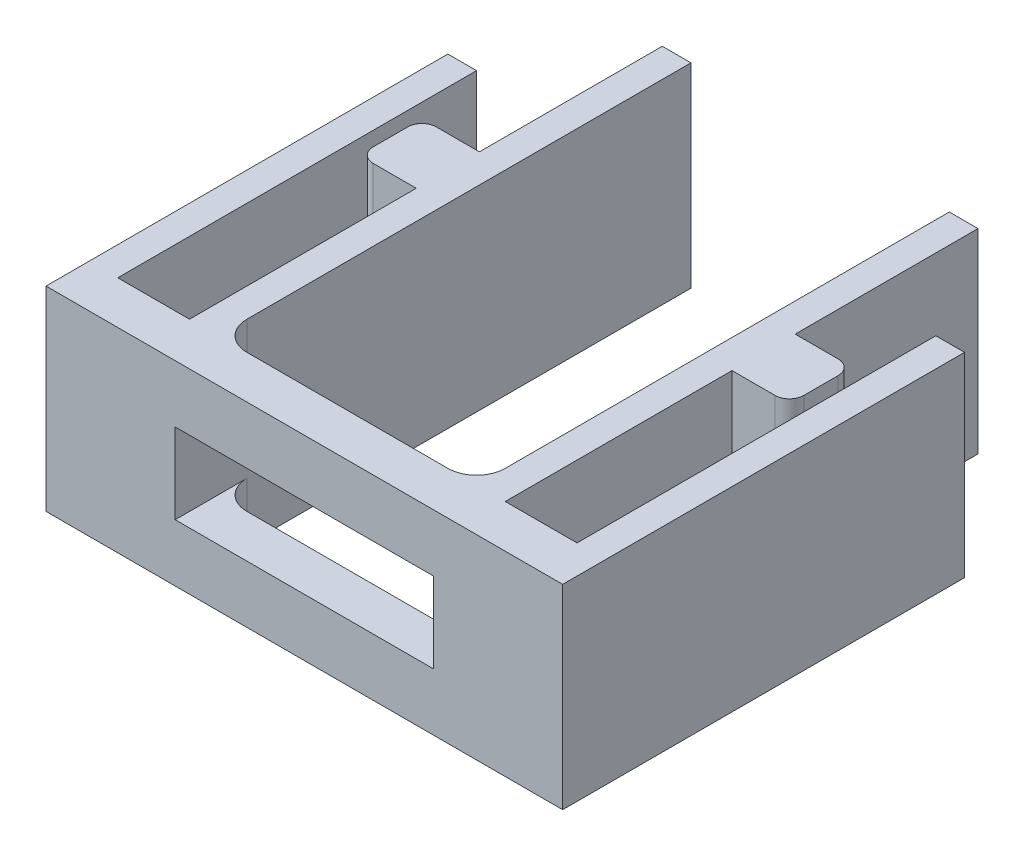
ISO-10303-21;
HEADER;
FILE_DESCRIPTION(('STEP AP214'),'2;1');
FILE_NAME('part.step','',(''),(''),'','','');
FILE_SCHEMA(('AUTOMOTIVE_DESIGN { 1 0 10303 214 1 1 1 1 }'));
ENDSEC;
DATA;
#1=APPLICATION_CONTEXT('core data for automotive mechanical design processes');
#2=APPLICATION_PROTOCOL_DEFINITION('international standard','automotive_design',2000,#1);
#3=PRODUCT_CONTEXT('',#1,'mechanical');
#4=PRODUCT('Part','Part','',(#3));
#5=PRODUCT_RELATED_PRODUCT_CATEGORY('part','',(#4));
#6=PRODUCT_DEFINITION_FORMATION('','',#4);
#7=PRODUCT_DEFINITION_CONTEXT('part definition',#1,'design');
#8=PRODUCT_DEFINITION('design','',#6,#7);
#9=PRODUCT_DEFINITION_SHAPE('','',#8);
#10=(LENGTH_UNIT() NAMED_UNIT(*) SI_UNIT(.MILLI.,.METRE.));
#11=(NAMED_UNIT(*) PLANE_ANGLE_UNIT() SI_UNIT($,.RADIAN.));
#12=(NAMED_UNIT(*) SI_UNIT($,.STERADIAN.) SOLID_ANGLE_UNIT());
#13=UNCERTAINTY_MEASURE_WITH_UNIT(LENGTH_MEASURE(1.E-05),#10,'distance_accuracy_value','');
#14=(GEOMETRIC_REPRESENTATION_CONTEXT(3) GLOBAL_UNCERTAINTY_ASSIGNED_CONTEXT((#13)) GLOBAL_UNIT_ASSIGNED_CONTEXT((#10,
#11,#12)) REPRESENTATION_CONTEXT('',''));
#15=CARTESIAN_POINT('',(0.,0.,0.));
#16=DIRECTION('',(0.,0.,1.));
#17=DIRECTION('',(1.,0.,0.));
#18=AXIS2_PLACEMENT_3D('',#15,#16,#17);
#19=CARTESIAN_POINT('',(12.5,6.8,-2.5));
#20=DIRECTION('',(0.,-1.,0.));
#21=DIRECTION('',(0.,0.,-1.));
#22=AXIS2_PLACEMENT_3D('',#19,#20,#21);
#23=CYLINDRICAL_SURFACE('',#22,1.);
#24=DIRECTION('',(0.,-1.,0.));
#25=VECTOR('',#24,1.);
#26=CARTESIAN_POINT('',(13.5,6.8,-2.5));
#27=LINE('',#26,#25);
#28=CARTESIAN_POINT('',(13.5,6.8,-2.5));
#29=VERTEX_POINT('',#28);
#30=CARTESIAN_POINT('',(13.5,4.8,-2.5));
#31=VERTEX_POINT('',#30);
#32=EDGE_CURVE('E469',#29,#31,#27,.T.);
#33=ORIENTED_EDGE('',*,*,#32,.T.);
#34=CARTESIAN_POINT('',(12.5,4.8,-2.5));
#35=DIRECTION('',(0.,1.,0.));
#36=DIRECTION('',(-1.,0.,0.));
#37=AXIS2_PLACEMENT_3D('',#34,#35,#36);
#38=CIRCLE('',#37,1.);
#39=CARTESIAN_POINT('',(12.5,4.8,-1.5));
#40=VERTEX_POINT('',#39);
#41=EDGE_CURVE('E315',#31,#40,#38,.F.);
#42=ORIENTED_EDGE('',*,*,#41,.T.);
#43=DIRECTION('',(0.,-1.,0.));
#44=VECTOR('',#43,1.);
#45=CARTESIAN_POINT('',(12.5,6.8,-1.5));
#46=LINE('',#45,#44);
#47=CARTESIAN_POINT('',(12.5,6.8,-1.5));
#48=VERTEX_POINT('',#47);
#49=EDGE_CURVE('E466',#48,#40,#46,.T.);
#50=ORIENTED_EDGE('',*,*,#49,.F.);
#51=CARTESIAN_POINT('',(12.5,6.8,-2.5));
#52=DIRECTION('',(0.,-1.,0.));
#53=DIRECTION('',(0.,0.,1.));
#54=AXIS2_PLACEMENT_3D('',#51,#52,#53);
#55=CIRCLE('',#54,1.);
#56=EDGE_CURVE('E346',#29,#48,#55,.T.);
#57=ORIENTED_EDGE('',*,*,#56,.F.);
#58=EDGE_LOOP('',(#33,#42,#50,#57));
#59=FACE_BOUND('',#58,.T.);
#60=ADVANCED_FACE('F33',(#59),#23,.F.);
#61=CARTESIAN_POINT('',(5.5,6.8,-1.5));
#62=DIRECTION('',(0.,0.,1.));
#63=DIRECTION('',(1.,0.,0.));
#64=AXIS2_PLACEMENT_3D('',#61,#62,#63);
#65=PLANE('',#64);
#66=ORIENTED_EDGE('',*,*,#49,.T.);
#67=DIRECTION('',(-1.,0.,0.));
#68=VECTOR('',#67,1.);
#69=CARTESIAN_POINT('',(5.5,4.8,-1.5));
#70=LINE('',#69,#68);
#71=CARTESIAN_POINT('',(5.5,4.8,-1.5));
#72=VERTEX_POINT('',#71);
#73=EDGE_CURVE('E312',#40,#72,#70,.T.);
#74=ORIENTED_EDGE('',*,*,#73,.T.);
#75=DIRECTION('',(0.,-1.,0.));
#76=VECTOR('',#75,1.);
#77=CARTESIAN_POINT('',(5.5,6.8,-1.5));
#78=LINE('',#77,#76);
#79=CARTESIAN_POINT('',(5.5,6.8,-1.5));
#80=VERTEX_POINT('',#79);
#81=EDGE_CURVE('E462',#80,#72,#78,.T.);
#82=ORIENTED_EDGE('',*,*,#81,.F.);
#83=DIRECTION('',(-1.,0.,0.));
#84=VECTOR('',#83,1.);
#85=CARTESIAN_POINT('',(5.5,6.8,-1.5));
#86=LINE('',#85,#84);
#87=EDGE_CURVE('E348',#48,#80,#86,.T.);
#88=ORIENTED_EDGE('',*,*,#87,.F.);
#89=EDGE_LOOP('',(#66,#74,#82,#88));
#90=FACE_BOUND('',#89,.T.);
#91=ADVANCED_FACE('F646',(#90),#65,.F.);
#92=CARTESIAN_POINT('',(5.5,6.8,-2.5));
#93=DIRECTION('',(0.,-1.,0.));
#94=DIRECTION('',(0.,0.,-1.));
#95=AXIS2_PLACEMENT_3D('',#92,#93,#94);
#96=CYLINDRICAL_SURFACE('',#95,1.);
#97=ORIENTED_EDGE('',*,*,#81,.T.);
#98=CARTESIAN_POINT('',(5.5,4.8,-2.5));
#99=DIRECTION('',(0.,1.,0.));
#100=DIRECTION('',(-1.,0.,0.));
#101=AXIS2_PLACEMENT_3D('',#98,#99,#100);
#102=CIRCLE('',#101,1.);
#103=CARTESIAN_POINT('',(4.5,4.8,-2.5));
#104=VERTEX_POINT('',#103);
#105=EDGE_CURVE('E309',#72,#104,#102,.F.);
#106=ORIENTED_EDGE('',*,*,#105,.T.);
#107=DIRECTION('',(0.,-1.,0.));
#108=VECTOR('',#107,1.);
#109=CARTESIAN_POINT('',(4.5,6.8,-2.5));
#110=LINE('',#109,#108);
#111=CARTESIAN_POINT('',(4.5,6.8,-2.5));
#112=VERTEX_POINT('',#111);
#113=EDGE_CURVE('E458',#112,#104,#110,.T.);
#114=ORIENTED_EDGE('',*,*,#113,.F.);
#115=CARTESIAN_POINT('',(5.5,6.8,-2.5));
#116=DIRECTION('',(0.,-1.,0.));
#117=DIRECTION('',(0.,0.,-1.));
#118=AXIS2_PLACEMENT_3D('',#115,#116,#117);
#119=CIRCLE('',#118,1.);
#120=EDGE_CURVE('E350',#80,#112,#119,.T.);
#121=ORIENTED_EDGE('',*,*,#120,.F.);
#122=EDGE_LOOP('',(#97,#106,#114,#121));
#123=FACE_BOUND('',#122,.T.);
#124=ADVANCED_FACE('F648',(#123),#96,.F.);
#125=CARTESIAN_POINT('',(18.,6.8,0.));
#126=DIRECTION('',(0.,0.,-1.));
#127=DIRECTION('',(-1.,0.,0.));
#128=AXIS2_PLACEMENT_3D('',#125,#126,#127);
#129=PLANE('',#128);
#130=DIRECTION('',(1.,0.,0.));
#131=VECTOR('',#130,1.);
#132=CARTESIAN_POINT('',(13.5,2.,0.));
#133=LINE('',#132,#131);
#134=CARTESIAN_POINT('',(4.5,2.,0.));
#135=VERTEX_POINT('',#134);
#136=CARTESIAN_POINT('',(13.5,2.,0.));
#137=VERTEX_POINT('',#136);
#138=EDGE_CURVE('E282',#135,#137,#133,.T.);
#139=ORIENTED_EDGE('',*,*,#138,.F.);
#140=DIRECTION('',(0.,-1.,0.));
#141=VECTOR('',#140,1.);
#142=CARTESIAN_POINT('',(4.5,2.,0.));
#143=LINE('',#142,#141);
#144=CARTESIAN_POINT('',(4.5,4.8,0.));
#145=VERTEX_POINT('',#144);
#146=EDGE_CURVE('E287',#145,#135,#143,.T.);
#147=ORIENTED_EDGE('',*,*,#146,.F.);
#148=DIRECTION('',(-1.,0.,0.));
#149=VECTOR('',#148,1.);
#150=CARTESIAN_POINT('',(13.5,4.8,0.));
#151=LINE('',#150,#149);
#152=CARTESIAN_POINT('',(13.5,4.8,0.));
#153=VERTEX_POINT('',#152);
#154=EDGE_CURVE('E292',#153,#145,#151,.T.);
#155=ORIENTED_EDGE('',*,*,#154,.F.);
#156=DIRECTION('',(0.,1.,0.));
#157=VECTOR('',#156,1.);
#158=CARTESIAN_POINT('',(13.5,2.,0.));
#159=LINE('',#158,#157);
#160=EDGE_CURVE('E271',#137,#153,#159,.T.);
#161=ORIENTED_EDGE('',*,*,#160,.F.);
#162=EDGE_LOOP('',(#139,#147,#155,#161));
#163=FACE_BOUND('',#162,.T.);
#164=DIRECTION('',(1.,0.,0.));
#165=VECTOR('',#164,1.);
#166=CARTESIAN_POINT('',(18.,0.,0.));
#167=LINE('',#166,#165);
#168=CARTESIAN_POINT('',(0.,0.,0.));
#169=VERTEX_POINT('',#168);
#170=CARTESIAN_POINT('',(18.,0.,0.));
#171=VERTEX_POINT('',#170);
#172=EDGE_CURVE('E318',#169,#171,#167,.T.);
#173=ORIENTED_EDGE('',*,*,#172,.T.);
#174=DIRECTION('',(0.,-1.,0.));
#175=VECTOR('',#174,1.);
#176=CARTESIAN_POINT('',(18.,6.8,0.));
#177=LINE('',#176,#175);
#178=CARTESIAN_POINT('',(18.,6.8,0.));
#179=VERTEX_POINT('',#178);
#180=EDGE_CURVE('E495',#179,#171,#177,.T.);
#181=ORIENTED_EDGE('',*,*,#180,.F.);
#182=DIRECTION('',(1.,0.,0.));
#183=VECTOR('',#182,1.);
#184=CARTESIAN_POINT('',(18.,6.8,0.));
#185=LINE('',#184,#183);
#186=CARTESIAN_POINT('',(0.,6.8,0.));
#187=VERTEX_POINT('',#186);
#188=EDGE_CURVE('E319',#187,#179,#185,.T.);
#189=ORIENTED_EDGE('',*,*,#188,.F.);
#190=DIRECTION('',(0.,-1.,0.));
#191=VECTOR('',#190,1.);
#192=CARTESIAN_POINT('',(0.,6.8,0.));
#193=LINE('',#192,#191);
#194=EDGE_CURVE('E374',#187,#169,#193,.T.);
#195=ORIENTED_EDGE('',*,*,#194,.T.);
#196=EDGE_LOOP('',(#173,#181,#189,#195));
#197=FACE_BOUND('',#196,.T.);
#198=ADVANCED_FACE('F289',(#163,#197),#129,.F.);
#199=CARTESIAN_POINT('',(18.,6.8,-14.));
#200=DIRECTION('',(-1.,0.,0.));
#201=DIRECTION('',(0.,0.,1.));
#202=AXIS2_PLACEMENT_3D('',#199,#200,#201);
#203=PLANE('',#202);
#204=DIRECTION('',(0.,0.,-1.));
#205=VECTOR('',#204,1.);
#206=CARTESIAN_POINT('',(18.,0.,-14.));
#207=LINE('',#206,#205);
#208=CARTESIAN_POINT('',(18.,0.,-14.));
#209=VERTEX_POINT('',#208);
#210=EDGE_CURVE('E377',#171,#209,#207,.T.);
#211=ORIENTED_EDGE('',*,*,#210,.T.);
#212=DIRECTION('',(0.,-1.,0.));
#213=VECTOR('',#212,1.);
#214=CARTESIAN_POINT('',(18.,6.8,-14.));
#215=LINE('',#214,#213);
#216=CARTESIAN_POINT('',(18.,6.8,-14.));
#217=VERTEX_POINT('',#216);
#218=EDGE_CURVE('E492',#217,#209,#215,.T.);
#219=ORIENTED_EDGE('',*,*,#218,.F.);
#220=DIRECTION('',(0.,0.,-1.));
#221=VECTOR('',#220,1.);
#222=CARTESIAN_POINT('',(18.,6.8,-14.));
#223=LINE('',#222,#221);
#224=EDGE_CURVE('E322',#179,#217,#223,.T.);
#225=ORIENTED_EDGE('',*,*,#224,.F.);
#226=ORIENTED_EDGE('',*,*,#180,.T.);
#227=EDGE_LOOP('',(#211,#219,#225,#226));
#228=FACE_BOUND('',#227,.T.);
#229=ADVANCED_FACE('F580',(#228),#203,.F.);
#230=CARTESIAN_POINT('',(17.,6.8,-14.));
#231=DIRECTION('',(0.,0.,1.));
#232=DIRECTION('',(1.,0.,0.));
#233=AXIS2_PLACEMENT_3D('',#230,#231,#232);
#234=PLANE('',#233);
#235=DIRECTION('',(-1.,0.,0.));
#236=VECTOR('',#235,1.);
#237=CARTESIAN_POINT('',(17.,0.,-14.));
#238=LINE('',#237,#236);
#239=CARTESIAN_POINT('',(17.,0.,-14.));
#240=VERTEX_POINT('',#239);
#241=EDGE_CURVE('E379',#209,#240,#238,.T.);
#242=ORIENTED_EDGE('',*,*,#241,.T.);
#243=DIRECTION('',(0.,-1.,0.));
#244=VECTOR('',#243,1.);
#245=CARTESIAN_POINT('',(17.,6.8,-14.));
#246=LINE('',#245,#244);
#247=CARTESIAN_POINT('',(17.,6.8,-14.));
#248=VERTEX_POINT('',#247);
#249=EDGE_CURVE('E489',#248,#240,#246,.T.);
#250=ORIENTED_EDGE('',*,*,#249,.F.);
#251=DIRECTION('',(-1.,0.,0.));
#252=VECTOR('',#251,1.);
#253=CARTESIAN_POINT('',(17.,6.8,-14.));
#254=LINE('',#253,#252);
#255=EDGE_CURVE('E325',#217,#248,#254,.T.);
#256=ORIENTED_EDGE('',*,*,#255,.F.);
#257=ORIENTED_EDGE('',*,*,#218,.T.);
#258=EDGE_LOOP('',(#242,#250,#256,#257));
#259=FACE_BOUND('',#258,.T.);
#260=ADVANCED_FACE('F587',(#259),#234,.F.);
#261=CARTESIAN_POINT('',(17.,6.8,-1.5));
#262=DIRECTION('',(1.,0.,0.));
#263=DIRECTION('',(0.,0.,-1.));
#264=AXIS2_PLACEMENT_3D('',#261,#262,#263);
#265=PLANE('',#264);
#266=DIRECTION('',(0.,0.,1.));
#267=VECTOR('',#266,1.);
#268=CARTESIAN_POINT('',(17.,0.,-1.5));
#269=LINE('',#268,#267);
#270=CARTESIAN_POINT('',(17.,0.,-1.5));
#271=VERTEX_POINT('',#270);
#272=EDGE_CURVE('E381',#240,#271,#269,.T.);
#273=ORIENTED_EDGE('',*,*,#272,.T.);
#274=DIRECTION('',(0.,-1.,0.));
#275=VECTOR('',#274,1.);
#276=CARTESIAN_POINT('',(17.,6.8,-1.5));
#277=LINE('',#276,#275);
#278=CARTESIAN_POINT('',(17.,6.8,-1.5));
#279=VERTEX_POINT('',#278);
#280=EDGE_CURVE('E486',#279,#271,#277,.T.);
#281=ORIENTED_EDGE('',*,*,#280,.F.);
#282=DIRECTION('',(0.,0.,1.));
#283=VECTOR('',#282,1.);
#284=CARTESIAN_POINT('',(17.,6.8,-1.5));
#285=LINE('',#284,#283);
#286=EDGE_CURVE('E327',#248,#279,#285,.T.);
#287=ORIENTED_EDGE('',*,*,#286,.F.);
#288=ORIENTED_EDGE('',*,*,#249,.T.);
#289=EDGE_LOOP('',(#273,#281,#287,#288));
#290=FACE_BOUND('',#289,.T.);
#291=ADVANCED_FACE('F591',(#290),#265,.F.);
#292=CARTESIAN_POINT('',(14.5,6.8,-1.5));
#293=DIRECTION('',(0.,0.,1.));
#294=DIRECTION('',(1.,0.,0.));
#295=AXIS2_PLACEMENT_3D('',#292,#293,#294);
#296=PLANE('',#295);
#297=DIRECTION('',(-1.,0.,0.));
#298=VECTOR('',#297,1.);
#299=CARTESIAN_POINT('',(14.5,0.,-1.5));
#300=LINE('',#299,#298);
#301=CARTESIAN_POINT('',(14.5,0.,-1.5));
#302=VERTEX_POINT('',#301);
#303=EDGE_CURVE('E383',#271,#302,#300,.T.);
#304=ORIENTED_EDGE('',*,*,#303,.T.);
#305=DIRECTION('',(0.,-1.,0.));
#306=VECTOR('',#305,1.);
#307=CARTESIAN_POINT('',(14.5,6.8,-1.5));
#308=LINE('',#307,#306);
#309=CARTESIAN_POINT('',(14.5,6.8,-1.5));
#310=VERTEX_POINT('',#309);
#311=EDGE_CURVE('E483',#310,#302,#308,.T.);
#312=ORIENTED_EDGE('',*,*,#311,.F.);
#313=DIRECTION('',(-1.,0.,0.));
#314=VECTOR('',#313,1.);
#315=CARTESIAN_POINT('',(14.5,6.8,-1.5));
#316=LINE('',#315,#314);
#317=EDGE_CURVE('E329',#279,#310,#316,.T.);
#318=ORIENTED_EDGE('',*,*,#317,.F.);
#319=ORIENTED_EDGE('',*,*,#280,.T.);
#320=EDGE_LOOP('',(#304,#312,#318,#319));
#321=FACE_BOUND('',#320,.T.);
#322=ADVANCED_FACE('F596',(#321),#296,.F.);
#323=CARTESIAN_POINT('',(14.5,6.8,-9.39999999999998));
#324=DIRECTION('',(-1.,0.,0.));
#325=DIRECTION('',(0.,0.,1.));
#326=AXIS2_PLACEMENT_3D('',#323,#324,#325);
#327=PLANE('',#326);
#328=DIRECTION('',(0.,0.,-1.));
#329=VECTOR('',#328,1.);
#330=CARTESIAN_POINT('',(14.5,0.,-9.39999999999998));
#331=LINE('',#330,#329);
#332=CARTESIAN_POINT('',(14.5,0.,-9.39999999999998));
#333=VERTEX_POINT('',#332);
#334=EDGE_CURVE('E385',#302,#333,#331,.T.);
#335=ORIENTED_EDGE('',*,*,#334,.T.);
#336=DIRECTION('',(0.,-1.,0.));
#337=VECTOR('',#336,1.);
#338=CARTESIAN_POINT('',(14.5,6.8,-9.39999999999998));
#339=LINE('',#338,#337);
#340=CARTESIAN_POINT('',(14.5,6.8,-9.39999999999998));
#341=VERTEX_POINT('',#340);
#342=EDGE_CURVE('E480',#341,#333,#339,.T.);
#343=ORIENTED_EDGE('',*,*,#342,.F.);
#344=DIRECTION('',(0.,0.,-1.));
#345=VECTOR('',#344,1.);
#346=CARTESIAN_POINT('',(14.5,6.8,-9.39999999999998));
#347=LINE('',#346,#345);
#348=EDGE_CURVE('E331',#310,#341,#347,.T.);
#349=ORIENTED_EDGE('',*,*,#348,.F.);
#350=ORIENTED_EDGE('',*,*,#311,.T.);
#351=EDGE_LOOP('',(#335,#343,#349,#350));
#352=FACE_BOUND('',#351,.T.);
#353=ADVANCED_FACE('F602',(#352),#327,.F.);
#354=CARTESIAN_POINT('',(16.5,6.8,-9.39999999999999));
#355=DIRECTION('',(0.,0.,-1.));
#356=DIRECTION('',(-1.,0.,0.));
#357=AXIS2_PLACEMENT_3D('',#354,#355,#356);
#358=PLANE('',#357);
#359=DIRECTION('',(1.,0.,0.));
#360=VECTOR('',#359,1.);
#361=CARTESIAN_POINT('',(16.5,0.,-9.39999999999999));
#362=LINE('',#361,#360);
#363=CARTESIAN_POINT('',(16.,0.,-9.39999999999999));
#364=VERTEX_POINT('',#363);
#365=EDGE_CURVE('E387',#333,#364,#362,.T.);
#366=ORIENTED_EDGE('',*,*,#365,.T.);
#367=DIRECTION('',(0.,-1.,0.));
#368=VECTOR('',#367,1.);
#369=CARTESIAN_POINT('',(16.,6.8,-9.39999999999999));
#370=LINE('',#369,#368);
#371=CARTESIAN_POINT('',(16.,6.8,-9.39999999999999));
#372=VERTEX_POINT('',#371);
#373=EDGE_CURVE('E514',#364,#372,#370,.F.);
#374=ORIENTED_EDGE('',*,*,#373,.T.);
#375=DIRECTION('',(1.,0.,0.));
#376=VECTOR('',#375,1.);
#377=CARTESIAN_POINT('',(16.5,6.8,-9.39999999999999));
#378=LINE('',#377,#376);
#379=EDGE_CURVE('E333',#341,#372,#378,.T.);
#380=ORIENTED_EDGE('',*,*,#379,.F.);
#381=ORIENTED_EDGE('',*,*,#342,.T.);
#382=EDGE_LOOP('',(#366,#374,#380,#381));
#383=FACE_BOUND('',#382,.T.);
#384=ADVANCED_FACE('F606',(#383),#358,.F.);
#385=CARTESIAN_POINT('',(16.5,6.8,-11.6));
#386=DIRECTION('',(-1.,0.,0.));
#387=DIRECTION('',(0.,0.,1.));
#388=AXIS2_PLACEMENT_3D('',#385,#386,#387);
#389=PLANE('',#388);
#390=DIRECTION('',(0.,0.,-1.));
#391=VECTOR('',#390,1.);
#392=CARTESIAN_POINT('',(16.5,6.8,-11.6));
#393=LINE('',#392,#391);
#394=CARTESIAN_POINT('',(16.5,6.8,-9.89999999999999));
#395=VERTEX_POINT('',#394);
#396=CARTESIAN_POINT('',(16.5,6.8,-11.1));
#397=VERTEX_POINT('',#396);
#398=EDGE_CURVE('E336',#395,#397,#393,.T.);
#399=ORIENTED_EDGE('',*,*,#398,.F.);
#400=DIRECTION('',(0.,-1.,0.));
#401=VECTOR('',#400,1.);
#402=CARTESIAN_POINT('',(16.5,6.8,-9.89999999999999));
#403=LINE('',#402,#401);
#404=CARTESIAN_POINT('',(16.5,0.,-9.89999999999999));
#405=VERTEX_POINT('',#404);
#406=EDGE_CURVE('E509',#395,#405,#403,.T.);
#407=ORIENTED_EDGE('',*,*,#406,.T.);
#408=DIRECTION('',(0.,0.,-1.));
#409=VECTOR('',#408,1.);
#410=CARTESIAN_POINT('',(16.5,0.,-11.6));
#411=LINE('',#410,#409);
#412=CARTESIAN_POINT('',(16.5,0.,-11.1));
#413=VERTEX_POINT('',#412);
#414=EDGE_CURVE('E390',#405,#413,#411,.T.);
#415=ORIENTED_EDGE('',*,*,#414,.T.);
#416=DIRECTION('',(0.,-1.,0.));
#417=VECTOR('',#416,1.);
#418=CARTESIAN_POINT('',(16.5,6.8,-11.1));
#419=LINE('',#418,#417);
#420=EDGE_CURVE('E504',#413,#397,#419,.F.);
#421=ORIENTED_EDGE('',*,*,#420,.T.);
#422=EDGE_LOOP('',(#399,#407,#415,#421));
#423=FACE_BOUND('',#422,.T.);
#424=ADVANCED_FACE('F613',(#423),#389,.F.);
#425=CARTESIAN_POINT('',(14.5,6.8,-11.6));
#426=DIRECTION('',(0.,0.,1.));
#427=DIRECTION('',(1.,0.,0.));
#428=AXIS2_PLACEMENT_3D('',#425,#426,#427);
#429=PLANE('',#428);
#430=DIRECTION('',(-1.,0.,0.));
#431=VECTOR('',#430,1.);
#432=CARTESIAN_POINT('',(14.5,6.8,-11.6));
#433=LINE('',#432,#431);
#434=CARTESIAN_POINT('',(16.,6.8,-11.6));
#435=VERTEX_POINT('',#434);
#436=CARTESIAN_POINT('',(14.5,6.8,-11.6));
#437=VERTEX_POINT('',#436);
#438=EDGE_CURVE('E338',#435,#437,#433,.T.);
#439=ORIENTED_EDGE('',*,*,#438,.F.);
#440=DIRECTION('',(0.,-1.,0.));
#441=VECTOR('',#440,1.);
#442=CARTESIAN_POINT('',(16.,6.8,-11.6));
#443=LINE('',#442,#441);
#444=CARTESIAN_POINT('',(16.,0.,-11.6));
#445=VERTEX_POINT('',#444);
#446=EDGE_CURVE('E498',#435,#445,#443,.T.);
#447=ORIENTED_EDGE('',*,*,#446,.T.);
#448=DIRECTION('',(-1.,0.,0.));
#449=VECTOR('',#448,1.);
#450=CARTESIAN_POINT('',(14.5,0.,-11.6));
#451=LINE('',#450,#449);
#452=CARTESIAN_POINT('',(14.5,0.,-11.6));
#453=VERTEX_POINT('',#452);
#454=EDGE_CURVE('E392',#445,#453,#451,.T.);
#455=ORIENTED_EDGE('',*,*,#454,.T.);
#456=DIRECTION('',(0.,-1.,0.));
#457=VECTOR('',#456,1.);
#458=CARTESIAN_POINT('',(14.5,6.8,-11.6));
#459=LINE('',#458,#457);
#460=EDGE_CURVE('E477',#437,#453,#459,.T.);
#461=ORIENTED_EDGE('',*,*,#460,.F.);
#462=EDGE_LOOP('',(#439,#447,#455,#461));
#463=FACE_BOUND('',#462,.T.);
#464=ADVANCED_FACE('F623',(#463),#429,.F.);
#465=CARTESIAN_POINT('',(14.5,6.8,-17.9696690920006));
#466=DIRECTION('',(-1.,0.,0.));
#467=DIRECTION('',(0.,0.,1.));
#468=AXIS2_PLACEMENT_3D('',#465,#466,#467);
#469=PLANE('',#468);
#470=DIRECTION('',(0.,0.,-1.));
#471=VECTOR('',#470,1.);
#472=CARTESIAN_POINT('',(14.5,0.,-17.9696690920006));
#473=LINE('',#472,#471);
#474=CARTESIAN_POINT('',(14.5,0.,-17.9696690920006));
#475=VERTEX_POINT('',#474);
#476=EDGE_CURVE('E394',#453,#475,#473,.T.);
#477=ORIENTED_EDGE('',*,*,#476,.T.);
#478=DIRECTION('',(0.,-1.,0.));
#479=VECTOR('',#478,1.);
#480=CARTESIAN_POINT('',(14.5,6.8,-17.9696690920006));
#481=LINE('',#480,#479);
#482=CARTESIAN_POINT('',(14.5,6.8,-17.9696690920006));
#483=VERTEX_POINT('',#482);
#484=EDGE_CURVE('E474',#483,#475,#481,.T.);
#485=ORIENTED_EDGE('',*,*,#484,.F.);
#486=DIRECTION('',(0.,0.,-1.));
#487=VECTOR('',#486,1.);
#488=CARTESIAN_POINT('',(14.5,6.8,-17.9696690920006));
#489=LINE('',#488,#487);
#490=EDGE_CURVE('E340',#437,#483,#489,.T.);
#491=ORIENTED_EDGE('',*,*,#490,.F.);
#492=ORIENTED_EDGE('',*,*,#460,.T.);
#493=EDGE_LOOP('',(#477,#485,#491,#492));
#494=FACE_BOUND('',#493,.T.);
#495=ADVANCED_FACE('F629',(#494),#469,.F.);
#496=CARTESIAN_POINT('',(13.5,6.8,-17.9696690920006));
#497=DIRECTION('',(0.,0.,1.));
#498=DIRECTION('',(1.,0.,0.));
#499=AXIS2_PLACEMENT_3D('',#496,#497,#498);
#500=PLANE('',#499);
#501=DIRECTION('',(-1.,0.,0.));
#502=VECTOR('',#501,1.);
#503=CARTESIAN_POINT('',(13.5,0.,-17.9696690920006));
#504=LINE('',#503,#502);
#505=CARTESIAN_POINT('',(13.5,0.,-17.9696690920006));
#506=VERTEX_POINT('',#505);
#507=EDGE_CURVE('E396',#475,#506,#504,.T.);
#508=ORIENTED_EDGE('',*,*,#507,.T.);
#509=DIRECTION('',(0.,-1.,0.));
#510=VECTOR('',#509,1.);
#511=CARTESIAN_POINT('',(13.5,6.8,-17.9696690920006));
#512=LINE('',#511,#510);
#513=CARTESIAN_POINT('',(13.5,6.8,-17.9696690920006));
#514=VERTEX_POINT('',#513);
#515=EDGE_CURVE('E472',#514,#506,#512,.T.);
#516=ORIENTED_EDGE('',*,*,#515,.F.);
#517=DIRECTION('',(-1.,0.,0.));
#518=VECTOR('',#517,1.);
#519=CARTESIAN_POINT('',(13.5,6.8,-17.9696690920006));
#520=LINE('',#519,#518);
#521=EDGE_CURVE('E342',#483,#514,#520,.T.);
#522=ORIENTED_EDGE('',*,*,#521,.F.);
#523=ORIENTED_EDGE('',*,*,#484,.T.);
#524=EDGE_LOOP('',(#508,#516,#522,#523));
#525=FACE_BOUND('',#524,.T.);
#526=ADVANCED_FACE('F635',(#525),#500,.F.);
#527=CARTESIAN_POINT('',(13.5,6.8,-2.5));
#528=DIRECTION('',(1.,0.,0.));
#529=DIRECTION('',(0.,0.,-1.));
#530=AXIS2_PLACEMENT_3D('',#527,#528,#529);
#531=PLANE('',#530);
#532=CARTESIAN_POINT('',(13.5,2.,-2.5));
#533=VERTEX_POINT('',#532);
#534=CARTESIAN_POINT('',(13.5,0.,-2.5));
#535=VERTEX_POINT('',#534);
#536=EDGE_CURVE('E274',#533,#535,#27,.T.);
#537=ORIENTED_EDGE('',*,*,#536,.F.);
#538=DIRECTION('',(0.,0.,1.));
#539=VECTOR('',#538,1.);
#540=CARTESIAN_POINT('',(13.5,2.,-17.9696690920006));
#541=LINE('',#540,#539);
#542=EDGE_CURVE('E266',#533,#137,#541,.T.);
#543=ORIENTED_EDGE('',*,*,#542,.T.);
#544=ORIENTED_EDGE('',*,*,#160,.T.);
#545=DIRECTION('',(0.,0.,1.));
#546=VECTOR('',#545,1.);
#547=CARTESIAN_POINT('',(13.5,4.8,-17.9696690920006));
#548=LINE('',#547,#546);
#549=EDGE_CURVE('E277',#31,#153,#548,.T.);
#550=ORIENTED_EDGE('',*,*,#549,.F.);
#551=ORIENTED_EDGE('',*,*,#32,.F.);
#552=DIRECTION('',(0.,0.,1.));
#553=VECTOR('',#552,1.);
#554=CARTESIAN_POINT('',(13.5,6.8,-2.5));
#555=LINE('',#554,#553);
#556=EDGE_CURVE('E344',#514,#29,#555,.T.);
#557=ORIENTED_EDGE('',*,*,#556,.F.);
#558=ORIENTED_EDGE('',*,*,#515,.T.);
#559=DIRECTION('',(0.,0.,1.));
#560=VECTOR('',#559,1.);
#561=CARTESIAN_POINT('',(13.5,0.,-2.5));
#562=LINE('',#561,#560);
#563=EDGE_CURVE('E399',#506,#535,#562,.T.);
#564=ORIENTED_EDGE('',*,*,#563,.T.);
#565=EDGE_LOOP('',(#537,#543,#544,#550,#551,#557,#558,#564));
#566=FACE_BOUND('',#565,.T.);
#567=ADVANCED_FACE('F268',(#566),#531,.F.);
#568=CARTESIAN_POINT('',(12.5,2.,-1.5));
#569=VERTEX_POINT('',#568);
#570=CARTESIAN_POINT('',(12.5,0.,-1.5));
#571=VERTEX_POINT('',#570);
#572=EDGE_CURVE('E465',#569,#571,#46,.T.);
#573=ORIENTED_EDGE('',*,*,#572,.F.);
#574=CARTESIAN_POINT('',(12.5,2.,-2.5));
#575=DIRECTION('',(0.,-1.,0.));
#576=DIRECTION('',(1.,0.,0.));
#577=AXIS2_PLACEMENT_3D('',#574,#575,#576);
#578=CIRCLE('',#577,1.);
#579=EDGE_CURVE('E307',#569,#533,#578,.F.);
#580=ORIENTED_EDGE('',*,*,#579,.T.);
#581=ORIENTED_EDGE('',*,*,#536,.T.);
#582=CARTESIAN_POINT('',(12.5,0.,-2.5));
#583=DIRECTION('',(0.,-1.,0.));
#584=DIRECTION('',(0.,0.,1.));
#585=AXIS2_PLACEMENT_3D('',#582,#583,#584);
#586=CIRCLE('',#585,1.);
#587=EDGE_CURVE('E401',#535,#571,#586,.T.);
#588=ORIENTED_EDGE('',*,*,#587,.T.);
#589=EDGE_LOOP('',(#573,#580,#581,#588));
#590=FACE_BOUND('',#589,.T.);
#591=ADVANCED_FACE('F670',(#590),#23,.F.);
#592=CARTESIAN_POINT('',(5.5,2.,-1.5));
#593=VERTEX_POINT('',#592);
#594=CARTESIAN_POINT('',(5.5,0.,-1.5));
#595=VERTEX_POINT('',#594);
#596=EDGE_CURVE('E461',#593,#595,#78,.T.);
#597=ORIENTED_EDGE('',*,*,#596,.F.);
#598=DIRECTION('',(1.,0.,0.));
#599=VECTOR('',#598,1.);
#600=CARTESIAN_POINT('',(5.50000000000001,2.,-1.5));
#601=LINE('',#600,#599);
#602=EDGE_CURVE('E304',#593,#569,#601,.T.);
#603=ORIENTED_EDGE('',*,*,#602,.T.);
#604=ORIENTED_EDGE('',*,*,#572,.T.);
#605=DIRECTION('',(-1.,0.,0.));
#606=VECTOR('',#605,1.);
#607=CARTESIAN_POINT('',(5.5,0.,-1.5));
#608=LINE('',#607,#606);
#609=EDGE_CURVE('E404',#571,#595,#608,.T.);
#610=ORIENTED_EDGE('',*,*,#609,.T.);
#611=EDGE_LOOP('',(#597,#603,#604,#610));
#612=FACE_BOUND('',#611,.T.);
#613=ADVANCED_FACE('F675',(#612),#65,.F.);
#614=CARTESIAN_POINT('',(4.5,2.,-2.5));
#615=VERTEX_POINT('',#614);
#616=CARTESIAN_POINT('',(4.5,0.,-2.5));
#617=VERTEX_POINT('',#616);
#618=EDGE_CURVE('E457',#615,#617,#110,.T.);
#619=ORIENTED_EDGE('',*,*,#618,.F.);
#620=CARTESIAN_POINT('',(5.5,2.,-2.5));
#621=DIRECTION('',(0.,-1.,0.));
#622=DIRECTION('',(1.,0.,0.));
#623=AXIS2_PLACEMENT_3D('',#620,#621,#622);
#624=CIRCLE('',#623,1.);
#625=EDGE_CURVE('E299',#615,#593,#624,.F.);
#626=ORIENTED_EDGE('',*,*,#625,.T.);
#627=ORIENTED_EDGE('',*,*,#596,.T.);
#628=CARTESIAN_POINT('',(5.5,0.,-2.5));
#629=DIRECTION('',(0.,-1.,0.));
#630=DIRECTION('',(0.,0.,-1.));
#631=AXIS2_PLACEMENT_3D('',#628,#629,#630);
#632=CIRCLE('',#631,1.);
#633=EDGE_CURVE('E407',#595,#617,#632,.T.);
#634=ORIENTED_EDGE('',*,*,#633,.T.);
#635=EDGE_LOOP('',(#619,#626,#627,#634));
#636=FACE_BOUND('',#635,.T.);
#637=ADVANCED_FACE('F683',(#636),#96,.F.);
#638=CARTESIAN_POINT('',(4.5,6.8,-17.9696690920006));
#639=DIRECTION('',(-1.,0.,0.));
#640=DIRECTION('',(0.,0.,1.));
#641=AXIS2_PLACEMENT_3D('',#638,#639,#640);
#642=PLANE('',#641);
#643=DIRECTION('',(0.,0.,-1.));
#644=VECTOR('',#643,1.);
#645=CARTESIAN_POINT('',(4.5,0.,-17.9696690920006));
#646=LINE('',#645,#644);
#647=CARTESIAN_POINT('',(4.5,0.,-17.9696690920006));
#648=VERTEX_POINT('',#647);
#649=EDGE_CURVE('E410',#617,#648,#646,.T.);
#650=ORIENTED_EDGE('',*,*,#649,.T.);
#651=DIRECTION('',(0.,-1.,0.));
#652=VECTOR('',#651,1.);
#653=CARTESIAN_POINT('',(4.5,6.8,-17.9696690920006));
#654=LINE('',#653,#652);
#655=CARTESIAN_POINT('',(4.5,6.8,-17.9696690920006));
#656=VERTEX_POINT('',#655);
#657=EDGE_CURVE('E455',#656,#648,#654,.T.);
#658=ORIENTED_EDGE('',*,*,#657,.F.);
#659=DIRECTION('',(0.,0.,-1.));
#660=VECTOR('',#659,1.);
#661=CARTESIAN_POINT('',(4.5,6.8,-17.9696690920006));
#662=LINE('',#661,#660);
#663=EDGE_CURVE('E352',#112,#656,#662,.T.);
#664=ORIENTED_EDGE('',*,*,#663,.F.);
#665=ORIENTED_EDGE('',*,*,#113,.T.);
#666=DIRECTION('',(0.,0.,1.));
#667=VECTOR('',#666,1.);
#668=CARTESIAN_POINT('',(4.5,4.8,-17.9696690920006));
#669=LINE('',#668,#667);
#670=EDGE_CURVE('E297',#104,#145,#669,.T.);
#671=ORIENTED_EDGE('',*,*,#670,.T.);
#672=ORIENTED_EDGE('',*,*,#146,.T.);
#673=DIRECTION('',(0.,0.,1.));
#674=VECTOR('',#673,1.);
#675=CARTESIAN_POINT('',(4.5,2.,-17.9696690920006));
#676=LINE('',#675,#674);
#677=EDGE_CURVE('E278',#615,#135,#676,.T.);
#678=ORIENTED_EDGE('',*,*,#677,.F.);
#679=ORIENTED_EDGE('',*,*,#618,.T.);
#680=EDGE_LOOP('',(#650,#658,#664,#665,#671,#672,#678,#679));
#681=FACE_BOUND('',#680,.T.);
#682=ADVANCED_FACE('F652',(#681),#642,.F.);
#683=CARTESIAN_POINT('',(3.5,6.8,-17.9696690920006));
#684=DIRECTION('',(0.,0.,1.));
#685=DIRECTION('',(1.,0.,0.));
#686=AXIS2_PLACEMENT_3D('',#683,#684,#685);
#687=PLANE('',#686);
#688=DIRECTION('',(-1.,0.,0.));
#689=VECTOR('',#688,1.);
#690=CARTESIAN_POINT('',(3.5,0.,-17.9696690920006));
#691=LINE('',#690,#689);
#692=CARTESIAN_POINT('',(3.5,0.,-17.9696690920006));
#693=VERTEX_POINT('',#692);
#694=EDGE_CURVE('E413',#648,#693,#691,.T.);
#695=ORIENTED_EDGE('',*,*,#694,.T.);
#696=DIRECTION('',(0.,-1.,0.));
#697=VECTOR('',#696,1.);
#698=CARTESIAN_POINT('',(3.5,6.8,-17.9696690920006));
#699=LINE('',#698,#697);
#700=CARTESIAN_POINT('',(3.5,6.8,-17.9696690920006));
#701=VERTEX_POINT('',#700);
#702=EDGE_CURVE('E452',#701,#693,#699,.T.);
#703=ORIENTED_EDGE('',*,*,#702,.F.);
#704=DIRECTION('',(-1.,0.,0.));
#705=VECTOR('',#704,1.);
#706=CARTESIAN_POINT('',(3.5,6.8,-17.9696690920006));
#707=LINE('',#706,#705);
#708=EDGE_CURVE('E354',#656,#701,#707,.T.);
#709=ORIENTED_EDGE('',*,*,#708,.F.);
#710=ORIENTED_EDGE('',*,*,#657,.T.);
#711=EDGE_LOOP('',(#695,#703,#709,#710));
#712=FACE_BOUND('',#711,.T.);
#713=ADVANCED_FACE('F658',(#712),#687,.F.);
#714=CARTESIAN_POINT('',(3.5,6.8,-11.6));
#715=DIRECTION('',(1.,0.,0.));
#716=DIRECTION('',(0.,0.,-1.));
#717=AXIS2_PLACEMENT_3D('',#714,#715,#716);
#718=PLANE('',#717);
#719=DIRECTION('',(0.,0.,1.));
#720=VECTOR('',#719,1.);
#721=CARTESIAN_POINT('',(3.5,0.,-11.6));
#722=LINE('',#721,#720);
#723=CARTESIAN_POINT('',(3.5,0.,-11.6));
#724=VERTEX_POINT('',#723);
#725=EDGE_CURVE('E415',#693,#724,#722,.T.);
#726=ORIENTED_EDGE('',*,*,#725,.T.);
#727=DIRECTION('',(0.,-1.,0.));
#728=VECTOR('',#727,1.);
#729=CARTESIAN_POINT('',(3.5,6.8,-11.6));
#730=LINE('',#729,#728);
#731=CARTESIAN_POINT('',(3.5,6.8,-11.6));
#732=VERTEX_POINT('',#731);
#733=EDGE_CURVE('E449',#732,#724,#730,.T.);
#734=ORIENTED_EDGE('',*,*,#733,.F.);
#735=DIRECTION('',(0.,0.,1.));
#736=VECTOR('',#735,1.);
#737=CARTESIAN_POINT('',(3.5,6.8,-11.6));
#738=LINE('',#737,#736);
#739=EDGE_CURVE('E356',#701,#732,#738,.T.);
#740=ORIENTED_EDGE('',*,*,#739,.F.);
#741=ORIENTED_EDGE('',*,*,#702,.T.);
#742=EDGE_LOOP('',(#726,#734,#740,#741));
#743=FACE_BOUND('',#742,.T.);
#744=ADVANCED_FACE('F662',(#743),#718,.F.);
#745=CARTESIAN_POINT('',(1.5,6.8,-11.6));
#746=DIRECTION('',(0.,0.,1.));
#747=DIRECTION('',(1.,0.,0.));
#748=AXIS2_PLACEMENT_3D('',#745,#746,#747);
#749=PLANE('',#748);
#750=DIRECTION('',(-1.,0.,0.));
#751=VECTOR('',#750,1.);
#752=CARTESIAN_POINT('',(1.5,0.,-11.6));
#753=LINE('',#752,#751);
#754=CARTESIAN_POINT('',(2.,0.,-11.6));
#755=VERTEX_POINT('',#754);
#756=EDGE_CURVE('E417',#724,#755,#753,.T.);
#757=ORIENTED_EDGE('',*,*,#756,.T.);
#758=DIRECTION('',(0.,-1.,0.));
#759=VECTOR('',#758,1.);
#760=CARTESIAN_POINT('',(2.,6.8,-11.6));
#761=LINE('',#760,#759);
#762=CARTESIAN_POINT('',(2.,6.8,-11.6));
#763=VERTEX_POINT('',#762);
#764=EDGE_CURVE('E41',#755,#763,#761,.F.);
#765=ORIENTED_EDGE('',*,*,#764,.T.);
#766=DIRECTION('',(-1.,0.,0.));
#767=VECTOR('',#766,1.);
#768=CARTESIAN_POINT('',(1.5,6.8,-11.6));
#769=LINE('',#768,#767);
#770=EDGE_CURVE('E358',#732,#763,#769,.T.);
#771=ORIENTED_EDGE('',*,*,#770,.F.);
#772=ORIENTED_EDGE('',*,*,#733,.T.);
#773=EDGE_LOOP('',(#757,#765,#771,#772));
#774=FACE_BOUND('',#773,.T.);
#775=ADVANCED_FACE('F663',(#774),#749,.F.);
#776=CARTESIAN_POINT('',(1.5,6.8,-9.39999999999998));
#777=DIRECTION('',(1.,0.,0.));
#778=DIRECTION('',(0.,0.,-1.));
#779=AXIS2_PLACEMENT_3D('',#776,#777,#778);
#780=PLANE('',#779);
#781=DIRECTION('',(0.,0.,1.));
#782=VECTOR('',#781,1.);
#783=CARTESIAN_POINT('',(1.5,6.8,-9.39999999999998));
#784=LINE('',#783,#782);
#785=CARTESIAN_POINT('',(1.5,6.8,-11.1));
#786=VERTEX_POINT('',#785);
#787=CARTESIAN_POINT('',(1.5,6.8,-9.89999999999998));
#788=VERTEX_POINT('',#787);
#789=EDGE_CURVE('E360',#786,#788,#784,.T.);
#790=ORIENTED_EDGE('',*,*,#789,.F.);
#791=DIRECTION('',(0.,-1.,0.));
#792=VECTOR('',#791,1.);
#793=CARTESIAN_POINT('',(1.5,6.8,-11.1));
#794=LINE('',#793,#792);
#795=CARTESIAN_POINT('',(1.5,0.,-11.1));
#796=VERTEX_POINT('',#795);
#797=EDGE_CURVE('E529',#786,#796,#794,.T.);
#798=ORIENTED_EDGE('',*,*,#797,.T.);
#799=DIRECTION('',(0.,0.,1.));
#800=VECTOR('',#799,1.);
#801=CARTESIAN_POINT('',(1.5,0.,-9.39999999999998));
#802=LINE('',#801,#800);
#803=CARTESIAN_POINT('',(1.5,0.,-9.89999999999998));
#804=VERTEX_POINT('',#803);
#805=EDGE_CURVE('E419',#796,#804,#802,.T.);
#806=ORIENTED_EDGE('',*,*,#805,.T.);
#807=DIRECTION('',(0.,-1.,0.));
#808=VECTOR('',#807,1.);
#809=CARTESIAN_POINT('',(1.5,6.8,-9.89999999999998));
#810=LINE('',#809,#808);
#811=EDGE_CURVE('E524',#804,#788,#810,.F.);
#812=ORIENTED_EDGE('',*,*,#811,.T.);
#813=EDGE_LOOP('',(#790,#798,#806,#812));
#814=FACE_BOUND('',#813,.T.);
#815=ADVANCED_FACE('F535',(#814),#780,.F.);
#816=CARTESIAN_POINT('',(3.5,6.8,-9.39999999999998));
#817=DIRECTION('',(0.,0.,-1.));
#818=DIRECTION('',(-1.,0.,0.));
#819=AXIS2_PLACEMENT_3D('',#816,#817,#818);
#820=PLANE('',#819);
#821=DIRECTION('',(1.,0.,0.));
#822=VECTOR('',#821,1.);
#823=CARTESIAN_POINT('',(3.5,6.8,-9.39999999999998));
#824=LINE('',#823,#822);
#825=CARTESIAN_POINT('',(2.,6.8,-9.39999999999998));
#826=VERTEX_POINT('',#825);
#827=CARTESIAN_POINT('',(3.5,6.8,-9.39999999999998));
#828=VERTEX_POINT('',#827);
#829=EDGE_CURVE('E362',#826,#828,#824,.T.);
#830=ORIENTED_EDGE('',*,*,#829,.F.);
#831=DIRECTION('',(0.,-1.,0.));
#832=VECTOR('',#831,1.);
#833=CARTESIAN_POINT('',(2.,6.8,-9.39999999999998));
#834=LINE('',#833,#832);
#835=CARTESIAN_POINT('',(2.,0.,-9.39999999999998));
#836=VERTEX_POINT('',#835);
#837=EDGE_CURVE('E518',#826,#836,#834,.T.);
#838=ORIENTED_EDGE('',*,*,#837,.T.);
#839=DIRECTION('',(1.,0.,0.));
#840=VECTOR('',#839,1.);
#841=CARTESIAN_POINT('',(3.5,0.,-9.39999999999998));
#842=LINE('',#841,#840);
#843=CARTESIAN_POINT('',(3.5,0.,-9.39999999999998));
#844=VERTEX_POINT('',#843);
#845=EDGE_CURVE('E421',#836,#844,#842,.T.);
#846=ORIENTED_EDGE('',*,*,#845,.T.);
#847=DIRECTION('',(0.,-1.,0.));
#848=VECTOR('',#847,1.);
#849=CARTESIAN_POINT('',(3.5,6.8,-9.39999999999998));
#850=LINE('',#849,#848);
#851=EDGE_CURVE('E446',#828,#844,#850,.T.);
#852=ORIENTED_EDGE('',*,*,#851,.F.);
#853=EDGE_LOOP('',(#830,#838,#846,#852));
#854=FACE_BOUND('',#853,.T.);
#855=ADVANCED_FACE('F551',(#854),#820,.F.);
#856=CARTESIAN_POINT('',(3.5,6.8,-1.5));
#857=DIRECTION('',(1.,0.,0.));
#858=DIRECTION('',(0.,0.,-1.));
#859=AXIS2_PLACEMENT_3D('',#856,#857,#858);
#860=PLANE('',#859);
#861=DIRECTION('',(0.,0.,1.));
#862=VECTOR('',#861,1.);
#863=CARTESIAN_POINT('',(3.5,0.,-1.5));
#864=LINE('',#863,#862);
#865=CARTESIAN_POINT('',(3.5,0.,-1.5));
#866=VERTEX_POINT('',#865);
#867=EDGE_CURVE('E423',#844,#866,#864,.T.);
#868=ORIENTED_EDGE('',*,*,#867,.T.);
#869=DIRECTION('',(0.,-1.,0.));
#870=VECTOR('',#869,1.);
#871=CARTESIAN_POINT('',(3.5,6.8,-1.5));
#872=LINE('',#871,#870);
#873=CARTESIAN_POINT('',(3.5,6.8,-1.5));
#874=VERTEX_POINT('',#873);
#875=EDGE_CURVE('E443',#874,#866,#872,.T.);
#876=ORIENTED_EDGE('',*,*,#875,.F.);
#877=DIRECTION('',(0.,0.,1.));
#878=VECTOR('',#877,1.);
#879=CARTESIAN_POINT('',(3.5,6.8,-1.5));
#880=LINE('',#879,#878);
#881=EDGE_CURVE('E364',#828,#874,#880,.T.);
#882=ORIENTED_EDGE('',*,*,#881,.F.);
#883=ORIENTED_EDGE('',*,*,#851,.T.);
#884=EDGE_LOOP('',(#868,#876,#882,#883));
#885=FACE_BOUND('',#884,.T.);
#886=ADVANCED_FACE('F555',(#885),#860,.F.);
#887=CARTESIAN_POINT('',(0.999999999999999,6.8,-1.5));
#888=DIRECTION('',(0.,0.,1.));
#889=DIRECTION('',(1.,0.,0.));
#890=AXIS2_PLACEMENT_3D('',#887,#888,#889);
#891=PLANE('',#890);
#892=DIRECTION('',(-1.,0.,0.));
#893=VECTOR('',#892,1.);
#894=CARTESIAN_POINT('',(0.999999999999999,0.,-1.5));
#895=LINE('',#894,#893);
#896=CARTESIAN_POINT('',(0.999999999999999,0.,-1.5));
#897=VERTEX_POINT('',#896);
#898=EDGE_CURVE('E425',#866,#897,#895,.T.);
#899=ORIENTED_EDGE('',*,*,#898,.T.);
#900=DIRECTION('',(0.,-1.,0.));
#901=VECTOR('',#900,1.);
#902=CARTESIAN_POINT('',(0.999999999999999,6.8,-1.5));
#903=LINE('',#902,#901);
#904=CARTESIAN_POINT('',(0.999999999999999,6.8,-1.5));
#905=VERTEX_POINT('',#904);
#906=EDGE_CURVE('E440',#905,#897,#903,.T.);
#907=ORIENTED_EDGE('',*,*,#906,.F.);
#908=DIRECTION('',(-1.,0.,0.));
#909=VECTOR('',#908,1.);
#910=CARTESIAN_POINT('',(0.999999999999999,6.8,-1.5));
#911=LINE('',#910,#909);
#912=EDGE_CURVE('E366',#874,#905,#911,.T.);
#913=ORIENTED_EDGE('',*,*,#912,.F.);
#914=ORIENTED_EDGE('',*,*,#875,.T.);
#915=EDGE_LOOP('',(#899,#907,#913,#914));
#916=FACE_BOUND('',#915,.T.);
#917=ADVANCED_FACE('F561',(#916),#891,.F.);
#918=CARTESIAN_POINT('',(0.999999999999999,6.8,-14.));
#919=DIRECTION('',(-1.,0.,0.));
#920=DIRECTION('',(0.,0.,1.));
#921=AXIS2_PLACEMENT_3D('',#918,#919,#920);
#922=PLANE('',#921);
#923=DIRECTION('',(0.,0.,-1.));
#924=VECTOR('',#923,1.);
#925=CARTESIAN_POINT('',(0.999999999999999,0.,-14.));
#926=LINE('',#925,#924);
#927=CARTESIAN_POINT('',(0.999999999999999,0.,-14.));
#928=VERTEX_POINT('',#927);
#929=EDGE_CURVE('E427',#897,#928,#926,.T.);
#930=ORIENTED_EDGE('',*,*,#929,.T.);
#931=DIRECTION('',(0.,-1.,0.));
#932=VECTOR('',#931,1.);
#933=CARTESIAN_POINT('',(0.999999999999999,6.8,-14.));
#934=LINE('',#933,#932);
#935=CARTESIAN_POINT('',(0.999999999999999,6.8,-14.));
#936=VERTEX_POINT('',#935);
#937=EDGE_CURVE('E437',#936,#928,#934,.T.);
#938=ORIENTED_EDGE('',*,*,#937,.F.);
#939=DIRECTION('',(0.,0.,-1.));
#940=VECTOR('',#939,1.);
#941=CARTESIAN_POINT('',(0.999999999999999,6.8,-14.));
#942=LINE('',#941,#940);
#943=EDGE_CURVE('E368',#905,#936,#942,.T.);
#944=ORIENTED_EDGE('',*,*,#943,.F.);
#945=ORIENTED_EDGE('',*,*,#906,.T.);
#946=EDGE_LOOP('',(#930,#938,#944,#945));
#947=FACE_BOUND('',#946,.T.);
#948=ADVANCED_FACE('F565',(#947),#922,.F.);
#949=CARTESIAN_POINT('',(0.,6.8,-14.));
#950=DIRECTION('',(0.,0.,1.));
#951=DIRECTION('',(1.,0.,0.));
#952=AXIS2_PLACEMENT_3D('',#949,#950,#951);
#953=PLANE('',#952);
#954=DIRECTION('',(-1.,0.,0.));
#955=VECTOR('',#954,1.);
#956=CARTESIAN_POINT('',(0.,0.,-14.));
#957=LINE('',#956,#955);
#958=CARTESIAN_POINT('',(0.,0.,-14.));
#959=VERTEX_POINT('',#958);
#960=EDGE_CURVE('E429',#928,#959,#957,.T.);
#961=ORIENTED_EDGE('',*,*,#960,.T.);
#962=DIRECTION('',(0.,-1.,0.));
#963=VECTOR('',#962,1.);
#964=CARTESIAN_POINT('',(0.,6.8,-14.));
#965=LINE('',#964,#963);
#966=CARTESIAN_POINT('',(0.,6.8,-14.));
#967=VERTEX_POINT('',#966);
#968=EDGE_CURVE('E434',#967,#959,#965,.T.);
#969=ORIENTED_EDGE('',*,*,#968,.F.);
#970=DIRECTION('',(-1.,0.,0.));
#971=VECTOR('',#970,1.);
#972=CARTESIAN_POINT('',(0.,6.8,-14.));
#973=LINE('',#972,#971);
#974=EDGE_CURVE('E370',#936,#967,#973,.T.);
#975=ORIENTED_EDGE('',*,*,#974,.F.);
#976=ORIENTED_EDGE('',*,*,#937,.T.);
#977=EDGE_LOOP('',(#961,#969,#975,#976));
#978=FACE_BOUND('',#977,.T.);
#979=ADVANCED_FACE('F570',(#978),#953,.F.);
#980=CARTESIAN_POINT('',(0.,6.8,0.));
#981=DIRECTION('',(1.,0.,0.));
#982=DIRECTION('',(0.,0.,-1.));
#983=AXIS2_PLACEMENT_3D('',#980,#981,#982);
#984=PLANE('',#983);
#985=DIRECTION('',(0.,0.,1.));
#986=VECTOR('',#985,1.);
#987=CARTESIAN_POINT('',(0.,0.,0.));
#988=LINE('',#987,#986);
#989=EDGE_CURVE('E323',#959,#169,#988,.T.);
#990=ORIENTED_EDGE('',*,*,#989,.T.);
#991=ORIENTED_EDGE('',*,*,#194,.F.);
#992=DIRECTION('',(0.,0.,1.));
#993=VECTOR('',#992,1.);
#994=CARTESIAN_POINT('',(0.,6.8,0.));
#995=LINE('',#994,#993);
#996=EDGE_CURVE('E372',#967,#187,#995,.T.);
#997=ORIENTED_EDGE('',*,*,#996,.F.);
#998=ORIENTED_EDGE('',*,*,#968,.T.);
#999=EDGE_LOOP('',(#990,#991,#997,#998));
#1000=FACE_BOUND('',#999,.T.);
#1001=ADVANCED_FACE('F576',(#1000),#984,.F.);
#1002=CARTESIAN_POINT('',(5.5,6.8,-2.5));
#1003=DIRECTION('',(0.,-1.,0.));
#1004=DIRECTION('',(0.,0.,-1.));
#1005=AXIS2_PLACEMENT_3D('',#1002,#1003,#1004);
#1006=PLANE('',#1005);
#1007=ORIENTED_EDGE('',*,*,#770,.T.);
#1008=CARTESIAN_POINT('',(2.,6.8,-11.1));
#1009=DIRECTION('',(0.,-1.,0.));
#1010=DIRECTION('',(0.,0.,-1.));
#1011=AXIS2_PLACEMENT_3D('',#1008,#1009,#1010);
#1012=CIRCLE('',#1011,0.5);
#1013=EDGE_CURVE('E11',#763,#786,#1012,.F.);
#1014=ORIENTED_EDGE('',*,*,#1013,.T.);
#1015=ORIENTED_EDGE('',*,*,#789,.T.);
#1016=CARTESIAN_POINT('',(2.,6.8,-9.89999999999998));
#1017=DIRECTION('',(0.,-1.,0.));
#1018=DIRECTION('',(0.,0.,-1.));
#1019=AXIS2_PLACEMENT_3D('',#1016,#1017,#1018);
#1020=CIRCLE('',#1019,0.5);
#1021=EDGE_CURVE('E527',#788,#826,#1020,.F.);
#1022=ORIENTED_EDGE('',*,*,#1021,.T.);
#1023=ORIENTED_EDGE('',*,*,#829,.T.);
#1024=ORIENTED_EDGE('',*,*,#881,.T.);
#1025=ORIENTED_EDGE('',*,*,#912,.T.);
#1026=ORIENTED_EDGE('',*,*,#943,.T.);
#1027=ORIENTED_EDGE('',*,*,#974,.T.);
#1028=ORIENTED_EDGE('',*,*,#996,.T.);
#1029=ORIENTED_EDGE('',*,*,#188,.T.);
#1030=ORIENTED_EDGE('',*,*,#224,.T.);
#1031=ORIENTED_EDGE('',*,*,#255,.T.);
#1032=ORIENTED_EDGE('',*,*,#286,.T.);
#1033=ORIENTED_EDGE('',*,*,#317,.T.);
#1034=ORIENTED_EDGE('',*,*,#348,.T.);
#1035=ORIENTED_EDGE('',*,*,#379,.T.);
#1036=CARTESIAN_POINT('',(16.,6.8,-9.89999999999999));
#1037=DIRECTION('',(0.,-1.,0.));
#1038=DIRECTION('',(0.,0.,-1.));
#1039=AXIS2_PLACEMENT_3D('',#1036,#1037,#1038);
#1040=CIRCLE('',#1039,0.5);
#1041=EDGE_CURVE('E516',#372,#395,#1040,.F.);
#1042=ORIENTED_EDGE('',*,*,#1041,.T.);
#1043=ORIENTED_EDGE('',*,*,#398,.T.);
#1044=CARTESIAN_POINT('',(16.,6.8,-11.1));
#1045=DIRECTION('',(0.,-1.,0.));
#1046=DIRECTION('',(0.,0.,-1.));
#1047=AXIS2_PLACEMENT_3D('',#1044,#1045,#1046);
#1048=CIRCLE('',#1047,0.5);
#1049=EDGE_CURVE('E507',#397,#435,#1048,.F.);
#1050=ORIENTED_EDGE('',*,*,#1049,.T.);
#1051=ORIENTED_EDGE('',*,*,#438,.T.);
#1052=ORIENTED_EDGE('',*,*,#490,.T.);
#1053=ORIENTED_EDGE('',*,*,#521,.T.);
#1054=ORIENTED_EDGE('',*,*,#556,.T.);
#1055=ORIENTED_EDGE('',*,*,#56,.T.);
#1056=ORIENTED_EDGE('',*,*,#87,.T.);
#1057=ORIENTED_EDGE('',*,*,#120,.T.);
#1058=ORIENTED_EDGE('',*,*,#663,.T.);
#1059=ORIENTED_EDGE('',*,*,#708,.T.);
#1060=ORIENTED_EDGE('',*,*,#739,.T.);
#1061=EDGE_LOOP('',(#1007,#1014,#1015,#1022,#1023,#1024,#1025,#1026,#1027,#1028,#1029,#1030,
#1031,#1032,#1033,#1034,#1035,#1042,#1043,#1050,#1051,#1052,#1053,#1054,#1055,#1056,#1057,#1058,
#1059,#1060));
#1062=FACE_BOUND('',#1061,.T.);
#1063=ADVANCED_FACE('F548',(#1062),#1006,.F.);
#1064=CARTESIAN_POINT('',(5.5,0.,-2.5));
#1065=DIRECTION('',(0.,-1.,0.));
#1066=DIRECTION('',(0.,0.,-1.));
#1067=AXIS2_PLACEMENT_3D('',#1064,#1065,#1066);
#1068=PLANE('',#1067);
#1069=ORIENTED_EDGE('',*,*,#805,.F.);
#1070=CARTESIAN_POINT('',(2.,0.,-11.1));
#1071=DIRECTION('',(0.,-1.,0.));
#1072=DIRECTION('',(0.,0.,-1.));
#1073=AXIS2_PLACEMENT_3D('',#1070,#1071,#1072);
#1074=CIRCLE('',#1073,0.5);
#1075=EDGE_CURVE('E55',#796,#755,#1074,.T.);
#1076=ORIENTED_EDGE('',*,*,#1075,.T.);
#1077=ORIENTED_EDGE('',*,*,#756,.F.);
#1078=ORIENTED_EDGE('',*,*,#725,.F.);
#1079=ORIENTED_EDGE('',*,*,#694,.F.);
#1080=ORIENTED_EDGE('',*,*,#649,.F.);
#1081=ORIENTED_EDGE('',*,*,#633,.F.);
#1082=ORIENTED_EDGE('',*,*,#609,.F.);
#1083=ORIENTED_EDGE('',*,*,#587,.F.);
#1084=ORIENTED_EDGE('',*,*,#563,.F.);
#1085=ORIENTED_EDGE('',*,*,#507,.F.);
#1086=ORIENTED_EDGE('',*,*,#476,.F.);
#1087=ORIENTED_EDGE('',*,*,#454,.F.);
#1088=CARTESIAN_POINT('',(16.,0.,-11.1));
#1089=DIRECTION('',(0.,-1.,0.));
#1090=DIRECTION('',(0.,0.,-1.));
#1091=AXIS2_PLACEMENT_3D('',#1088,#1089,#1090);
#1092=CIRCLE('',#1091,0.5);
#1093=EDGE_CURVE('E501',#445,#413,#1092,.T.);
#1094=ORIENTED_EDGE('',*,*,#1093,.T.);
#1095=ORIENTED_EDGE('',*,*,#414,.F.);
#1096=CARTESIAN_POINT('',(16.,0.,-9.89999999999999));
#1097=DIRECTION('',(0.,-1.,0.));
#1098=DIRECTION('',(0.,0.,-1.));
#1099=AXIS2_PLACEMENT_3D('',#1096,#1097,#1098);
#1100=CIRCLE('',#1099,0.5);
#1101=EDGE_CURVE('E512',#405,#364,#1100,.T.);
#1102=ORIENTED_EDGE('',*,*,#1101,.T.);
#1103=ORIENTED_EDGE('',*,*,#365,.F.);
#1104=ORIENTED_EDGE('',*,*,#334,.F.);
#1105=ORIENTED_EDGE('',*,*,#303,.F.);
#1106=ORIENTED_EDGE('',*,*,#272,.F.);
#1107=ORIENTED_EDGE('',*,*,#241,.F.);
#1108=ORIENTED_EDGE('',*,*,#210,.F.);
#1109=ORIENTED_EDGE('',*,*,#172,.F.);
#1110=ORIENTED_EDGE('',*,*,#989,.F.);
#1111=ORIENTED_EDGE('',*,*,#960,.F.);
#1112=ORIENTED_EDGE('',*,*,#929,.F.);
#1113=ORIENTED_EDGE('',*,*,#898,.F.);
#1114=ORIENTED_EDGE('',*,*,#867,.F.);
#1115=ORIENTED_EDGE('',*,*,#845,.F.);
#1116=CARTESIAN_POINT('',(2.,0.,-9.89999999999998));
#1117=DIRECTION('',(0.,-1.,0.));
#1118=DIRECTION('',(0.,0.,-1.));
#1119=AXIS2_PLACEMENT_3D('',#1116,#1117,#1118);
#1120=CIRCLE('',#1119,0.5);
#1121=EDGE_CURVE('E521',#836,#804,#1120,.T.);
#1122=ORIENTED_EDGE('',*,*,#1121,.T.);
#1123=EDGE_LOOP('',(#1069,#1076,#1077,#1078,#1079,#1080,#1081,#1082,#1083,#1084,#1085,#1086,
#1087,#1094,#1095,#1102,#1103,#1104,#1105,#1106,#1107,#1108,#1109,#1110,#1111,#1112,#1113,#1114,
#1115,#1122));
#1124=FACE_BOUND('',#1123,.T.);
#1125=ADVANCED_FACE('F538',(#1124),#1068,.T.);
#1126=CARTESIAN_POINT('',(13.5,4.8,-17.9696690920006));
#1127=DIRECTION('',(0.,1.,0.));
#1128=DIRECTION('',(-1.,0.,0.));
#1129=AXIS2_PLACEMENT_3D('',#1126,#1127,#1128);
#1130=PLANE('',#1129);
#1131=ORIENTED_EDGE('',*,*,#549,.T.);
#1132=ORIENTED_EDGE('',*,*,#154,.T.);
#1133=ORIENTED_EDGE('',*,*,#670,.F.);
#1134=ORIENTED_EDGE('',*,*,#105,.F.);
#1135=ORIENTED_EDGE('',*,*,#73,.F.);
#1136=ORIENTED_EDGE('',*,*,#41,.F.);
#1137=EDGE_LOOP('',(#1131,#1132,#1133,#1134,#1135,#1136));
#1138=FACE_BOUND('',#1137,.T.);
#1139=ADVANCED_FACE('F694',(#1138),#1130,.F.);
#1140=CARTESIAN_POINT('',(13.5,2.,-17.9696690920006));
#1141=DIRECTION('',(0.,-1.,0.));
#1142=DIRECTION('',(1.,0.,0.));
#1143=AXIS2_PLACEMENT_3D('',#1140,#1141,#1142);
#1144=PLANE('',#1143);
#1145=ORIENTED_EDGE('',*,*,#602,.F.);
#1146=ORIENTED_EDGE('',*,*,#625,.F.);
#1147=ORIENTED_EDGE('',*,*,#677,.T.);
#1148=ORIENTED_EDGE('',*,*,#138,.T.);
#1149=ORIENTED_EDGE('',*,*,#542,.F.);
#1150=ORIENTED_EDGE('',*,*,#579,.F.);
#1151=EDGE_LOOP('',(#1145,#1146,#1147,#1148,#1149,#1150));
#1152=FACE_BOUND('',#1151,.T.);
#1153=ADVANCED_FACE('F283',(#1152),#1144,.F.);
#1154=CARTESIAN_POINT('',(16.,6.8,-11.1));
#1155=DIRECTION('',(0.,-1.,0.));
#1156=DIRECTION('',(0.,0.,-1.));
#1157=AXIS2_PLACEMENT_3D('',#1154,#1155,#1156);
#1158=CYLINDRICAL_SURFACE('',#1157,0.5);
#1159=ORIENTED_EDGE('',*,*,#1049,.F.);
#1160=ORIENTED_EDGE('',*,*,#420,.F.);
#1161=ORIENTED_EDGE('',*,*,#1093,.F.);
#1162=ORIENTED_EDGE('',*,*,#446,.F.);
#1163=EDGE_LOOP('',(#1159,#1160,#1161,#1162));
#1164=FACE_BOUND('',#1163,.T.);
#1165=ADVANCED_FACE('F619',(#1164),#1158,.T.);
#1166=CARTESIAN_POINT('',(16.,6.8,-9.89999999999999));
#1167=DIRECTION('',(0.,-1.,0.));
#1168=DIRECTION('',(0.,0.,-1.));
#1169=AXIS2_PLACEMENT_3D('',#1166,#1167,#1168);
#1170=CYLINDRICAL_SURFACE('',#1169,0.5);
#1171=ORIENTED_EDGE('',*,*,#1041,.F.);
#1172=ORIENTED_EDGE('',*,*,#373,.F.);
#1173=ORIENTED_EDGE('',*,*,#1101,.F.);
#1174=ORIENTED_EDGE('',*,*,#406,.F.);
#1175=EDGE_LOOP('',(#1171,#1172,#1173,#1174));
#1176=FACE_BOUND('',#1175,.T.);
#1177=ADVANCED_FACE('F609',(#1176),#1170,.T.);
#1178=CARTESIAN_POINT('',(2.,6.8,-9.89999999999998));
#1179=DIRECTION('',(0.,-1.,0.));
#1180=DIRECTION('',(0.,0.,-1.));
#1181=AXIS2_PLACEMENT_3D('',#1178,#1179,#1180);
#1182=CYLINDRICAL_SURFACE('',#1181,0.5);
#1183=ORIENTED_EDGE('',*,*,#1021,.F.);
#1184=ORIENTED_EDGE('',*,*,#811,.F.);
#1185=ORIENTED_EDGE('',*,*,#1121,.F.);
#1186=ORIENTED_EDGE('',*,*,#837,.F.);
#1187=EDGE_LOOP('',(#1183,#1184,#1185,#1186));
#1188=FACE_BOUND('',#1187,.T.);
#1189=ADVANCED_FACE('F545',(#1188),#1182,.T.);
#1190=CARTESIAN_POINT('',(2.,6.8,-11.1));
#1191=DIRECTION('',(0.,-1.,0.));
#1192=DIRECTION('',(0.,0.,-1.));
#1193=AXIS2_PLACEMENT_3D('',#1190,#1191,#1192);
#1194=CYLINDRICAL_SURFACE('',#1193,0.5);
#1195=ORIENTED_EDGE('',*,*,#1013,.F.);
#1196=ORIENTED_EDGE('',*,*,#764,.F.);
#1197=ORIENTED_EDGE('',*,*,#1075,.F.);
#1198=ORIENTED_EDGE('',*,*,#797,.F.);
#1199=EDGE_LOOP('',(#1195,#1196,#1197,#1198));
#1200=FACE_BOUND('',#1199,.T.);
#1201=ADVANCED_FACE('F35',(#1200),#1194,.T.);
#1202=CLOSED_SHELL('',(#60,#91,#124,#198,#229,#260,#291,#322,#353,#384,#424,#464,#495,#526,#567,
#591,#613,#637,#682,#713,#744,#775,#815,#855,#886,#917,#948,#979,#1001,#1063,#1125,#1139,#1153,
#1165,#1177,#1189,#1201));
#1203=MANIFOLD_SOLID_BREP('B2',#1202);
#1204=ADVANCED_BREP_SHAPE_REPRESENTATION('',(#18,#1203),#14);
#1205=SHAPE_DEFINITION_REPRESENTATION(#9,#1204);
ENDSEC;
END-ISO-10303-21;
